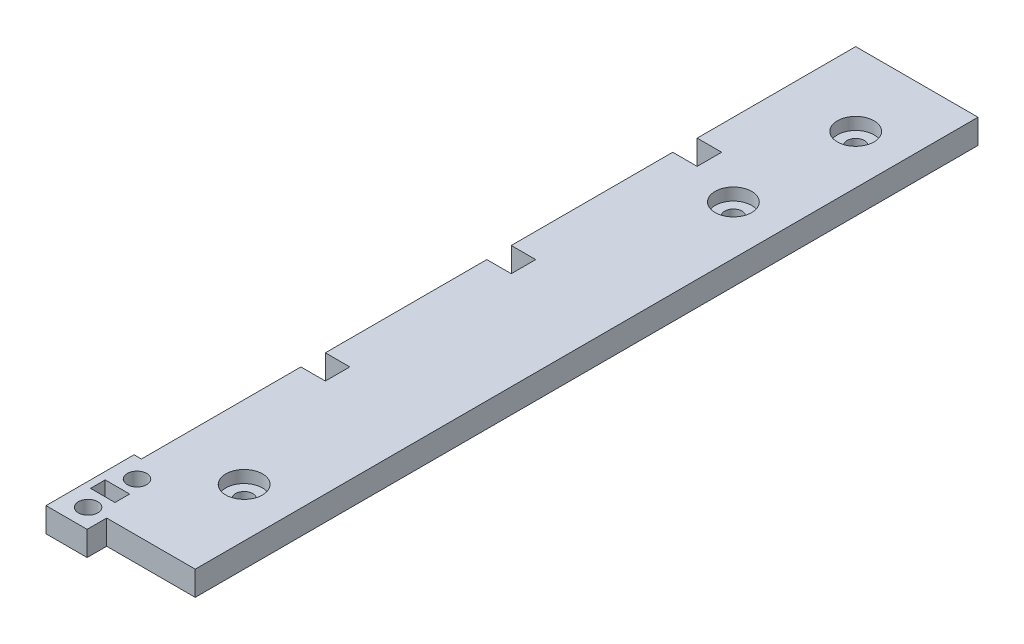
ISO-10303-21;
HEADER;
FILE_DESCRIPTION(('STEP AP214'),'2;1');
FILE_NAME('part.step','',(''),(''),'','','');
FILE_SCHEMA(('AUTOMOTIVE_DESIGN { 1 0 10303 214 1 1 1 1 }'));
ENDSEC;
DATA;
#1=APPLICATION_CONTEXT('core data for automotive mechanical design processes');
#2=APPLICATION_PROTOCOL_DEFINITION('international standard','automotive_design',2000,#1);
#3=PRODUCT_CONTEXT('',#1,'mechanical');
#4=PRODUCT('Part','Part','',(#3));
#5=PRODUCT_RELATED_PRODUCT_CATEGORY('part','',(#4));
#6=PRODUCT_DEFINITION_FORMATION('','',#4);
#7=PRODUCT_DEFINITION_CONTEXT('part definition',#1,'design');
#8=PRODUCT_DEFINITION('design','',#6,#7);
#9=PRODUCT_DEFINITION_SHAPE('','',#8);
#10=(LENGTH_UNIT() NAMED_UNIT(*) SI_UNIT(.MILLI.,.METRE.));
#11=(NAMED_UNIT(*) PLANE_ANGLE_UNIT() SI_UNIT($,.RADIAN.));
#12=(NAMED_UNIT(*) SI_UNIT($,.STERADIAN.) SOLID_ANGLE_UNIT());
#13=UNCERTAINTY_MEASURE_WITH_UNIT(LENGTH_MEASURE(1.E-05),#10,'distance_accuracy_value','');
#14=(GEOMETRIC_REPRESENTATION_CONTEXT(3) GLOBAL_UNCERTAINTY_ASSIGNED_CONTEXT((#13)) GLOBAL_UNIT_ASSIGNED_CONTEXT((#10,
#11,#12)) REPRESENTATION_CONTEXT('',''));
#15=CARTESIAN_POINT('',(0.,0.,0.));
#16=DIRECTION('',(0.,0.,1.));
#17=DIRECTION('',(1.,0.,0.));
#18=AXIS2_PLACEMENT_3D('',#15,#16,#17);
#19=CARTESIAN_POINT('',(0.,0.,0.));
#20=DIRECTION('',(0.,-1.,0.));
#21=DIRECTION('',(0.,0.,-1.));
#22=AXIS2_PLACEMENT_3D('',#19,#20,#21);
#23=PLANE('',#22);
#24=CARTESIAN_POINT('',(19.05,0.,-173.818608744557));
#25=DIRECTION('',(0.,1.,0.));
#26=DIRECTION('',(0.,0.,1.));
#27=AXIS2_PLACEMENT_3D('',#24,#25,#26);
#28=CIRCLE('',#27,2.24790000000001);
#29=CARTESIAN_POINT('',(19.05,0.,-171.570708744557));
#30=VERTEX_POINT('',#29);
#31=EDGE_CURVE('E803',#30,#30,#28,.T.);
#32=ORIENTED_EDGE('',*,*,#31,.T.);
#33=EDGE_LOOP('',(#32));
#34=FACE_BOUND('',#33,.T.);
#35=CARTESIAN_POINT('',(19.05,0.,-142.068608744557));
#36=DIRECTION('',(0.,1.,0.));
#37=DIRECTION('',(0.,0.,1.));
#38=AXIS2_PLACEMENT_3D('',#35,#36,#37);
#39=CIRCLE('',#38,2.24790000000001);
#40=CARTESIAN_POINT('',(19.05,0.,-139.820708744557));
#41=VERTEX_POINT('',#40);
#42=EDGE_CURVE('E814',#41,#41,#39,.T.);
#43=ORIENTED_EDGE('',*,*,#42,.T.);
#44=EDGE_LOOP('',(#43));
#45=FACE_BOUND('',#44,.T.);
#46=CARTESIAN_POINT('',(19.05,0.,-15.0686087445573));
#47=DIRECTION('',(0.,1.,0.));
#48=DIRECTION('',(0.,0.,1.));
#49=AXIS2_PLACEMENT_3D('',#46,#47,#48);
#50=CIRCLE('',#49,2.24790000000001);
#51=CARTESIAN_POINT('',(19.05,0.,-12.8207087445573));
#52=VERTEX_POINT('',#51);
#53=EDGE_CURVE('E217',#52,#52,#50,.T.);
#54=ORIENTED_EDGE('',*,*,#53,.T.);
#55=EDGE_LOOP('',(#54));
#56=FACE_BOUND('',#55,.T.);
#57=DIRECTION('',(0.,0.,1.));
#58=VECTOR('',#57,1.);
#59=CARTESIAN_POINT('',(0.,0.,5.75939125544268));
#60=LINE('',#59,#58);
#61=CARTESIAN_POINT('',(0.,0.,1.94939125544268));
#62=VERTEX_POINT('',#61);
#63=CARTESIAN_POINT('',(0.,0.,5.75939125544268));
#64=VERTEX_POINT('',#63);
#65=EDGE_CURVE('E196',#62,#64,#60,.T.);
#66=ORIENTED_EDGE('',*,*,#65,.T.);
#67=DIRECTION('',(1.,0.,0.));
#68=VECTOR('',#67,1.);
#69=CARTESIAN_POINT('',(6.35,0.,5.75939125544268));
#70=LINE('',#69,#68);
#71=CARTESIAN_POINT('',(6.35,0.,5.75939125544268));
#72=VERTEX_POINT('',#71);
#73=EDGE_CURVE('E205',#64,#72,#70,.T.);
#74=ORIENTED_EDGE('',*,*,#73,.T.);
#75=DIRECTION('',(0.,0.,-1.));
#76=VECTOR('',#75,1.);
#77=CARTESIAN_POINT('',(6.35,0.,1.94939125544268));
#78=LINE('',#77,#76);
#79=CARTESIAN_POINT('',(6.35,0.,1.94939125544268));
#80=VERTEX_POINT('',#79);
#81=EDGE_CURVE('E48',#72,#80,#78,.T.);
#82=ORIENTED_EDGE('',*,*,#81,.T.);
#83=DIRECTION('',(-1.,0.,0.));
#84=VECTOR('',#83,1.);
#85=CARTESIAN_POINT('',(0.,0.,1.94939125544268));
#86=LINE('',#85,#84);
#87=EDGE_CURVE('E202',#80,#62,#86,.T.);
#88=ORIENTED_EDGE('',*,*,#87,.T.);
#89=EDGE_LOOP('',(#66,#74,#82,#88));
#90=FACE_BOUND('',#89,.T.);
#91=CARTESIAN_POINT('',(3.937,0.,-2.36860874455731));
#92=DIRECTION('',(0.,1.,0.));
#93=DIRECTION('',(0.,0.,1.));
#94=AXIS2_PLACEMENT_3D('',#91,#92,#93);
#95=CIRCLE('',#94,2.52729999999999);
#96=CARTESIAN_POINT('',(3.937,0.,0.158691255442675));
#97=VERTEX_POINT('',#96);
#98=EDGE_CURVE('E235',#97,#97,#95,.T.);
#99=ORIENTED_EDGE('',*,*,#98,.T.);
#100=EDGE_LOOP('',(#99));
#101=FACE_BOUND('',#100,.T.);
#102=DIRECTION('',(-1.,0.,0.));
#103=VECTOR('',#102,1.);
#104=CARTESIAN_POINT('',(0.,0.,-55.2006087445573));
#105=LINE('',#104,#103);
#106=CARTESIAN_POINT('',(6.35000000000001,0.,-55.2006087445573));
#107=VERTEX_POINT('',#106);
#108=CARTESIAN_POINT('',(0.,0.,-55.2006087445573));
#109=VERTEX_POINT('',#108);
#110=EDGE_CURVE('E252',#107,#109,#105,.T.);
#111=ORIENTED_EDGE('',*,*,#110,.T.);
#112=DIRECTION('',(0.,0.,1.));
#113=VECTOR('',#112,1.);
#114=CARTESIAN_POINT('',(0.,0.,-7.44860874455731));
#115=LINE('',#114,#113);
#116=CARTESIAN_POINT('',(0.,0.,-97.1106087445573));
#117=VERTEX_POINT('',#116);
#118=EDGE_CURVE('E432',#117,#109,#115,.T.);
#119=ORIENTED_EDGE('',*,*,#118,.F.);
#120=DIRECTION('',(1.,0.,0.));
#121=VECTOR('',#120,1.);
#122=CARTESIAN_POINT('',(0.,0.,-97.1106087445573));
#123=LINE('',#122,#121);
#124=CARTESIAN_POINT('',(6.35,0.,-97.1106087445573));
#125=VERTEX_POINT('',#124);
#126=EDGE_CURVE('E273',#117,#125,#123,.T.);
#127=ORIENTED_EDGE('',*,*,#126,.T.);
#128=DIRECTION('',(0.,0.,-1.));
#129=VECTOR('',#128,1.);
#130=CARTESIAN_POINT('',(6.34999999999997,0.,-103.460608744557));
#131=LINE('',#130,#129);
#132=CARTESIAN_POINT('',(6.34999999999997,0.,-103.460608744557));
#133=VERTEX_POINT('',#132);
#134=EDGE_CURVE('E276',#125,#133,#131,.T.);
#135=ORIENTED_EDGE('',*,*,#134,.T.);
#136=DIRECTION('',(-1.,0.,0.));
#137=VECTOR('',#136,1.);
#138=CARTESIAN_POINT('',(0.,0.,-103.460608744557));
#139=LINE('',#138,#137);
#140=CARTESIAN_POINT('',(0.,0.,-103.460608744557));
#141=VERTEX_POINT('',#140);
#142=EDGE_CURVE('E280',#133,#141,#139,.T.);
#143=ORIENTED_EDGE('',*,*,#142,.T.);
#144=CARTESIAN_POINT('',(0.,0.,-145.370608744557));
#145=VERTEX_POINT('',#144);
#146=EDGE_CURVE('E354',#145,#141,#115,.T.);
#147=ORIENTED_EDGE('',*,*,#146,.F.);
#148=DIRECTION('',(1.,0.,0.));
#149=VECTOR('',#148,1.);
#150=CARTESIAN_POINT('',(0.,0.,-145.370608744557));
#151=LINE('',#150,#149);
#152=CARTESIAN_POINT('',(6.34999999999995,0.,-145.370608744557));
#153=VERTEX_POINT('',#152);
#154=EDGE_CURVE('E299',#145,#153,#151,.T.);
#155=ORIENTED_EDGE('',*,*,#154,.T.);
#156=DIRECTION('',(0.,0.,-1.));
#157=VECTOR('',#156,1.);
#158=CARTESIAN_POINT('',(6.34999999999995,0.,-151.720608744557));
#159=LINE('',#158,#157);
#160=CARTESIAN_POINT('',(6.34999999999995,0.,-151.720608744557));
#161=VERTEX_POINT('',#160);
#162=EDGE_CURVE('E302',#153,#161,#159,.T.);
#163=ORIENTED_EDGE('',*,*,#162,.T.);
#164=DIRECTION('',(-1.,0.,0.));
#165=VECTOR('',#164,1.);
#166=CARTESIAN_POINT('',(0.,0.,-151.720608744557));
#167=LINE('',#166,#165);
#168=CARTESIAN_POINT('',(0.,0.,-151.720608744557));
#169=VERTEX_POINT('',#168);
#170=EDGE_CURVE('E306',#161,#169,#167,.T.);
#171=ORIENTED_EDGE('',*,*,#170,.T.);
#172=CARTESIAN_POINT('',(0.,0.,-192.868608744557));
#173=VERTEX_POINT('',#172);
#174=EDGE_CURVE('E350',#173,#169,#115,.T.);
#175=ORIENTED_EDGE('',*,*,#174,.F.);
#176=DIRECTION('',(-1.,0.,0.));
#177=VECTOR('',#176,1.);
#178=CARTESIAN_POINT('',(0.,0.,-192.868608744557));
#179=LINE('',#178,#177);
#180=CARTESIAN_POINT('',(31.75,0.,-192.868608744557));
#181=VERTEX_POINT('',#180);
#182=EDGE_CURVE('E347',#181,#173,#179,.T.);
#183=ORIENTED_EDGE('',*,*,#182,.F.);
#184=DIRECTION('',(0.,0.,-1.));
#185=VECTOR('',#184,1.);
#186=CARTESIAN_POINT('',(31.75,0.,10.3313912554427));
#187=LINE('',#186,#185);
#188=CARTESIAN_POINT('',(31.75,0.,10.3313912554427));
#189=VERTEX_POINT('',#188);
#190=EDGE_CURVE('E267',#189,#181,#187,.T.);
#191=ORIENTED_EDGE('',*,*,#190,.F.);
#192=DIRECTION('',(1.,0.,0.));
#193=VECTOR('',#192,1.);
#194=CARTESIAN_POINT('',(8.763,0.,10.3313912554427));
#195=LINE('',#194,#193);
#196=CARTESIAN_POINT('',(8.763,0.,10.3313912554427));
#197=VERTEX_POINT('',#196);
#198=EDGE_CURVE('E327',#197,#189,#195,.T.);
#199=ORIENTED_EDGE('',*,*,#198,.F.);
#200=DIRECTION('',(0.,0.,-1.));
#201=VECTOR('',#200,1.);
#202=CARTESIAN_POINT('',(8.763,0.,10.3313912554427));
#203=LINE('',#202,#201);
#204=CARTESIAN_POINT('',(8.763,0.,15.4113912554427));
#205=VERTEX_POINT('',#204);
#206=EDGE_CURVE('E360',#205,#197,#203,.T.);
#207=ORIENTED_EDGE('',*,*,#206,.F.);
#208=DIRECTION('',(1.,0.,0.));
#209=VECTOR('',#208,1.);
#210=CARTESIAN_POINT('',(8.763,0.,15.4113912554427));
#211=LINE('',#210,#209);
#212=CARTESIAN_POINT('',(-1.905,0.,15.4113912554427));
#213=VERTEX_POINT('',#212);
#214=EDGE_CURVE('E358',#213,#205,#211,.T.);
#215=ORIENTED_EDGE('',*,*,#214,.F.);
#216=DIRECTION('',(0.,0.,1.));
#217=VECTOR('',#216,1.);
#218=CARTESIAN_POINT('',(-1.905,0.,15.4113912554427));
#219=LINE('',#218,#217);
#220=CARTESIAN_POINT('',(-1.905,0.,-7.44860874455731));
#221=VERTEX_POINT('',#220);
#222=EDGE_CURVE('E356',#221,#213,#219,.T.);
#223=ORIENTED_EDGE('',*,*,#222,.F.);
#224=DIRECTION('',(-1.,0.,0.));
#225=VECTOR('',#224,1.);
#226=CARTESIAN_POINT('',(-1.905,0.,-7.44860874455731));
#227=LINE('',#226,#225);
#228=CARTESIAN_POINT('',(0.,0.,-7.44860874455731));
#229=VERTEX_POINT('',#228);
#230=EDGE_CURVE('E353',#229,#221,#227,.T.);
#231=ORIENTED_EDGE('',*,*,#230,.F.);
#232=CARTESIAN_POINT('',(0.,0.,-48.8506087445573));
#233=VERTEX_POINT('',#232);
#234=EDGE_CURVE('E349',#233,#229,#115,.T.);
#235=ORIENTED_EDGE('',*,*,#234,.F.);
#236=DIRECTION('',(1.,0.,0.));
#237=VECTOR('',#236,1.);
#238=CARTESIAN_POINT('',(0.,0.,-48.8506087445573));
#239=LINE('',#238,#237);
#240=CARTESIAN_POINT('',(6.35,0.,-48.8506087445573));
#241=VERTEX_POINT('',#240);
#242=EDGE_CURVE('E245',#233,#241,#239,.T.);
#243=ORIENTED_EDGE('',*,*,#242,.T.);
#244=DIRECTION('',(0.,0.,-1.));
#245=VECTOR('',#244,1.);
#246=CARTESIAN_POINT('',(6.35000000000001,0.,-55.2006087445573));
#247=LINE('',#246,#245);
#248=EDGE_CURVE('E248',#241,#107,#247,.T.);
#249=ORIENTED_EDGE('',*,*,#248,.T.);
#250=EDGE_LOOP('',(#111,#119,#127,#135,#143,#147,#155,#163,#171,#175,#183,#191,#199,#207,#215,
#223,#231,#235,#243,#249));
#251=FACE_BOUND('',#250,.T.);
#252=CARTESIAN_POINT('',(3.937,0.,10.3313912554427));
#253=DIRECTION('',(0.,1.,0.));
#254=DIRECTION('',(0.,0.,1.));
#255=AXIS2_PLACEMENT_3D('',#252,#253,#254);
#256=CIRCLE('',#255,2.52729999999999);
#257=CARTESIAN_POINT('',(3.937,0.,12.8586912554427));
#258=VERTEX_POINT('',#257);
#259=EDGE_CURVE('E241',#258,#258,#256,.T.);
#260=ORIENTED_EDGE('',*,*,#259,.T.);
#261=EDGE_LOOP('',(#260));
#262=FACE_BOUND('',#261,.T.);
#263=ADVANCED_FACE('F33',(#34,#45,#56,#90,#101,#251,#262),#23,.T.);
#264=CARTESIAN_POINT('',(0.,6.35,-7.44860874455731));
#265=DIRECTION('',(1.,0.,0.));
#266=DIRECTION('',(0.,0.,-1.));
#267=AXIS2_PLACEMENT_3D('',#264,#265,#266);
#268=PLANE('',#267);
#269=ORIENTED_EDGE('',*,*,#118,.T.);
#270=DIRECTION('',(0.,1.,0.));
#271=VECTOR('',#270,1.);
#272=CARTESIAN_POINT('',(0.,0.,-55.2006087445573));
#273=LINE('',#272,#271);
#274=CARTESIAN_POINT('',(0.,6.35,-55.2006087445573));
#275=VERTEX_POINT('',#274);
#276=EDGE_CURVE('E264',#109,#275,#273,.T.);
#277=ORIENTED_EDGE('',*,*,#276,.T.);
#278=DIRECTION('',(0.,0.,1.));
#279=VECTOR('',#278,1.);
#280=CARTESIAN_POINT('',(0.,6.35,-7.44860874455731));
#281=LINE('',#280,#279);
#282=CARTESIAN_POINT('',(0.,6.35,-97.1106087445573));
#283=VERTEX_POINT('',#282);
#284=EDGE_CURVE('E451',#283,#275,#281,.T.);
#285=ORIENTED_EDGE('',*,*,#284,.F.);
#286=DIRECTION('',(0.,1.,0.));
#287=VECTOR('',#286,1.);
#288=CARTESIAN_POINT('',(0.,0.,-97.1106087445573));
#289=LINE('',#288,#287);
#290=EDGE_CURVE('E283',#117,#283,#289,.T.);
#291=ORIENTED_EDGE('',*,*,#290,.F.);
#292=EDGE_LOOP('',(#269,#277,#285,#291));
#293=FACE_BOUND('',#292,.T.);
#294=ADVANCED_FACE('F464',(#293),#268,.F.);
#295=ORIENTED_EDGE('',*,*,#146,.T.);
#296=DIRECTION('',(0.,1.,0.));
#297=VECTOR('',#296,1.);
#298=CARTESIAN_POINT('',(0.,0.,-103.460608744557));
#299=LINE('',#298,#297);
#300=CARTESIAN_POINT('',(0.,6.35,-103.460608744557));
#301=VERTEX_POINT('',#300);
#302=EDGE_CURVE('E260',#141,#301,#299,.T.);
#303=ORIENTED_EDGE('',*,*,#302,.T.);
#304=CARTESIAN_POINT('',(0.,6.35,-145.370608744557));
#305=VERTEX_POINT('',#304);
#306=EDGE_CURVE('E334',#305,#301,#281,.T.);
#307=ORIENTED_EDGE('',*,*,#306,.F.);
#308=DIRECTION('',(0.,1.,0.));
#309=VECTOR('',#308,1.);
#310=CARTESIAN_POINT('',(0.,0.,-145.370608744557));
#311=LINE('',#310,#309);
#312=EDGE_CURVE('E309',#145,#305,#311,.T.);
#313=ORIENTED_EDGE('',*,*,#312,.F.);
#314=EDGE_LOOP('',(#295,#303,#307,#313));
#315=FACE_BOUND('',#314,.T.);
#316=ADVANCED_FACE('F441',(#315),#268,.F.);
#317=ORIENTED_EDGE('',*,*,#174,.T.);
#318=DIRECTION('',(0.,1.,0.));
#319=VECTOR('',#318,1.);
#320=CARTESIAN_POINT('',(0.,0.,-151.720608744557));
#321=LINE('',#320,#319);
#322=CARTESIAN_POINT('',(0.,6.35,-151.720608744557));
#323=VERTEX_POINT('',#322);
#324=EDGE_CURVE('E288',#169,#323,#321,.T.);
#325=ORIENTED_EDGE('',*,*,#324,.T.);
#326=CARTESIAN_POINT('',(0.,6.35,-192.868608744557));
#327=VERTEX_POINT('',#326);
#328=EDGE_CURVE('E330',#327,#323,#281,.T.);
#329=ORIENTED_EDGE('',*,*,#328,.F.);
#330=DIRECTION('',(0.,-1.,0.));
#331=VECTOR('',#330,1.);
#332=CARTESIAN_POINT('',(0.,6.35,-192.868608744557));
#333=LINE('',#332,#331);
#334=EDGE_CURVE('E41',#327,#173,#333,.T.);
#335=ORIENTED_EDGE('',*,*,#334,.T.);
#336=EDGE_LOOP('',(#317,#325,#329,#335));
#337=FACE_BOUND('',#336,.T.);
#338=ADVANCED_FACE('F384',(#337),#268,.F.);
#339=CARTESIAN_POINT('',(31.75,6.35,10.3313912554427));
#340=DIRECTION('',(-1.,0.,0.));
#341=DIRECTION('',(0.,0.,1.));
#342=AXIS2_PLACEMENT_3D('',#339,#340,#341);
#343=PLANE('',#342);
#344=ORIENTED_EDGE('',*,*,#190,.T.);
#345=DIRECTION('',(0.,-1.,0.));
#346=VECTOR('',#345,1.);
#347=CARTESIAN_POINT('',(31.75,6.35,-192.868608744557));
#348=LINE('',#347,#346);
#349=CARTESIAN_POINT('',(31.75,6.35,-192.868608744557));
#350=VERTEX_POINT('',#349);
#351=EDGE_CURVE('E11',#350,#181,#348,.T.);
#352=ORIENTED_EDGE('',*,*,#351,.F.);
#353=DIRECTION('',(0.,0.,-1.));
#354=VECTOR('',#353,1.);
#355=CARTESIAN_POINT('',(31.75,6.35,10.3313912554427));
#356=LINE('',#355,#354);
#357=CARTESIAN_POINT('',(31.75,6.35,10.3313912554427));
#358=VERTEX_POINT('',#357);
#359=EDGE_CURVE('E323',#358,#350,#356,.T.);
#360=ORIENTED_EDGE('',*,*,#359,.F.);
#361=DIRECTION('',(0.,-1.,0.));
#362=VECTOR('',#361,1.);
#363=CARTESIAN_POINT('',(31.75,6.35,10.3313912554427));
#364=LINE('',#363,#362);
#365=EDGE_CURVE('E344',#358,#189,#364,.T.);
#366=ORIENTED_EDGE('',*,*,#365,.T.);
#367=EDGE_LOOP('',(#344,#352,#360,#366));
#368=FACE_BOUND('',#367,.T.);
#369=ADVANCED_FACE('F35',(#368),#343,.F.);
#370=CARTESIAN_POINT('',(0.,6.35,-192.868608744557));
#371=DIRECTION('',(0.,0.,1.));
#372=DIRECTION('',(1.,0.,0.));
#373=AXIS2_PLACEMENT_3D('',#370,#371,#372);
#374=PLANE('',#373);
#375=ORIENTED_EDGE('',*,*,#182,.T.);
#376=ORIENTED_EDGE('',*,*,#334,.F.);
#377=DIRECTION('',(-1.,0.,0.));
#378=VECTOR('',#377,1.);
#379=CARTESIAN_POINT('',(0.,6.35,-192.868608744557));
#380=LINE('',#379,#378);
#381=EDGE_CURVE('E326',#350,#327,#380,.T.);
#382=ORIENTED_EDGE('',*,*,#381,.F.);
#383=ORIENTED_EDGE('',*,*,#351,.T.);
#384=EDGE_LOOP('',(#375,#376,#382,#383));
#385=FACE_BOUND('',#384,.T.);
#386=ADVANCED_FACE('F399',(#385),#374,.F.);
#387=CARTESIAN_POINT('',(0.,6.35,-48.8506087445573));
#388=VERTEX_POINT('',#387);
#389=CARTESIAN_POINT('',(0.,6.35,-7.44860874455731));
#390=VERTEX_POINT('',#389);
#391=EDGE_CURVE('E329',#388,#390,#281,.T.);
#392=ORIENTED_EDGE('',*,*,#391,.F.);
#393=DIRECTION('',(0.,1.,0.));
#394=VECTOR('',#393,1.);
#395=CARTESIAN_POINT('',(0.,0.,-48.8506087445573));
#396=LINE('',#395,#394);
#397=EDGE_CURVE('E255',#233,#388,#396,.T.);
#398=ORIENTED_EDGE('',*,*,#397,.F.);
#399=ORIENTED_EDGE('',*,*,#234,.T.);
#400=DIRECTION('',(0.,-1.,0.));
#401=VECTOR('',#400,1.);
#402=CARTESIAN_POINT('',(0.,6.35,-7.44860874455731));
#403=LINE('',#402,#401);
#404=EDGE_CURVE('E377',#390,#229,#403,.T.);
#405=ORIENTED_EDGE('',*,*,#404,.F.);
#406=EDGE_LOOP('',(#392,#398,#399,#405));
#407=FACE_BOUND('',#406,.T.);
#408=ADVANCED_FACE('F430',(#407),#268,.F.);
#409=CARTESIAN_POINT('',(-1.905,6.35,-7.44860874455731));
#410=DIRECTION('',(0.,0.,1.));
#411=DIRECTION('',(1.,0.,0.));
#412=AXIS2_PLACEMENT_3D('',#409,#410,#411);
#413=PLANE('',#412);
#414=ORIENTED_EDGE('',*,*,#230,.T.);
#415=DIRECTION('',(0.,-1.,0.));
#416=VECTOR('',#415,1.);
#417=CARTESIAN_POINT('',(-1.905,6.35,-7.44860874455731));
#418=LINE('',#417,#416);
#419=CARTESIAN_POINT('',(-1.905,6.35,-7.44860874455731));
#420=VERTEX_POINT('',#419);
#421=EDGE_CURVE('E374',#420,#221,#418,.T.);
#422=ORIENTED_EDGE('',*,*,#421,.F.);
#423=DIRECTION('',(-1.,0.,0.));
#424=VECTOR('',#423,1.);
#425=CARTESIAN_POINT('',(-1.905,6.35,-7.44860874455731));
#426=LINE('',#425,#424);
#427=EDGE_CURVE('E333',#390,#420,#426,.T.);
#428=ORIENTED_EDGE('',*,*,#427,.F.);
#429=ORIENTED_EDGE('',*,*,#404,.T.);
#430=EDGE_LOOP('',(#414,#422,#428,#429));
#431=FACE_BOUND('',#430,.T.);
#432=ADVANCED_FACE('F426',(#431),#413,.F.);
#433=CARTESIAN_POINT('',(-1.905,6.35,15.4113912554427));
#434=DIRECTION('',(1.,0.,0.));
#435=DIRECTION('',(0.,0.,-1.));
#436=AXIS2_PLACEMENT_3D('',#433,#434,#435);
#437=PLANE('',#436);
#438=ORIENTED_EDGE('',*,*,#222,.T.);
#439=DIRECTION('',(0.,-1.,0.));
#440=VECTOR('',#439,1.);
#441=CARTESIAN_POINT('',(-1.905,6.35,15.4113912554427));
#442=LINE('',#441,#440);
#443=CARTESIAN_POINT('',(-1.905,6.35,15.4113912554427));
#444=VERTEX_POINT('',#443);
#445=EDGE_CURVE('E371',#444,#213,#442,.T.);
#446=ORIENTED_EDGE('',*,*,#445,.F.);
#447=DIRECTION('',(0.,0.,1.));
#448=VECTOR('',#447,1.);
#449=CARTESIAN_POINT('',(-1.905,6.35,15.4113912554427));
#450=LINE('',#449,#448);
#451=EDGE_CURVE('E336',#420,#444,#450,.T.);
#452=ORIENTED_EDGE('',*,*,#451,.F.);
#453=ORIENTED_EDGE('',*,*,#421,.T.);
#454=EDGE_LOOP('',(#438,#446,#452,#453));
#455=FACE_BOUND('',#454,.T.);
#456=ADVANCED_FACE('F421',(#455),#437,.F.);
#457=CARTESIAN_POINT('',(8.763,6.35,15.4113912554427));
#458=DIRECTION('',(0.,0.,-1.));
#459=DIRECTION('',(-1.,0.,0.));
#460=AXIS2_PLACEMENT_3D('',#457,#458,#459);
#461=PLANE('',#460);
#462=ORIENTED_EDGE('',*,*,#214,.T.);
#463=DIRECTION('',(0.,-1.,0.));
#464=VECTOR('',#463,1.);
#465=CARTESIAN_POINT('',(8.763,6.35,15.4113912554427));
#466=LINE('',#465,#464);
#467=CARTESIAN_POINT('',(8.763,6.35,15.4113912554427));
#468=VERTEX_POINT('',#467);
#469=EDGE_CURVE('E368',#468,#205,#466,.T.);
#470=ORIENTED_EDGE('',*,*,#469,.F.);
#471=DIRECTION('',(1.,0.,0.));
#472=VECTOR('',#471,1.);
#473=CARTESIAN_POINT('',(8.763,6.35,15.4113912554427));
#474=LINE('',#473,#472);
#475=EDGE_CURVE('E338',#444,#468,#474,.T.);
#476=ORIENTED_EDGE('',*,*,#475,.F.);
#477=ORIENTED_EDGE('',*,*,#445,.T.);
#478=EDGE_LOOP('',(#462,#470,#476,#477));
#479=FACE_BOUND('',#478,.T.);
#480=ADVANCED_FACE('F415',(#479),#461,.F.);
#481=CARTESIAN_POINT('',(8.763,6.35,10.3313912554427));
#482=DIRECTION('',(-1.,0.,0.));
#483=DIRECTION('',(0.,0.,1.));
#484=AXIS2_PLACEMENT_3D('',#481,#482,#483);
#485=PLANE('',#484);
#486=ORIENTED_EDGE('',*,*,#206,.T.);
#487=DIRECTION('',(0.,-1.,0.));
#488=VECTOR('',#487,1.);
#489=CARTESIAN_POINT('',(8.763,6.35,10.3313912554427));
#490=LINE('',#489,#488);
#491=CARTESIAN_POINT('',(8.763,6.35,10.3313912554427));
#492=VERTEX_POINT('',#491);
#493=EDGE_CURVE('E365',#492,#197,#490,.T.);
#494=ORIENTED_EDGE('',*,*,#493,.F.);
#495=DIRECTION('',(0.,0.,-1.));
#496=VECTOR('',#495,1.);
#497=CARTESIAN_POINT('',(8.763,6.35,10.3313912554427));
#498=LINE('',#497,#496);
#499=EDGE_CURVE('E340',#468,#492,#498,.T.);
#500=ORIENTED_EDGE('',*,*,#499,.F.);
#501=ORIENTED_EDGE('',*,*,#469,.T.);
#502=EDGE_LOOP('',(#486,#494,#500,#501));
#503=FACE_BOUND('',#502,.T.);
#504=ADVANCED_FACE('F411',(#503),#485,.F.);
#505=CARTESIAN_POINT('',(8.763,6.35,10.3313912554427));
#506=DIRECTION('',(0.,0.,-1.));
#507=DIRECTION('',(-1.,0.,0.));
#508=AXIS2_PLACEMENT_3D('',#505,#506,#507);
#509=PLANE('',#508);
#510=ORIENTED_EDGE('',*,*,#198,.T.);
#511=ORIENTED_EDGE('',*,*,#365,.F.);
#512=DIRECTION('',(1.,0.,0.));
#513=VECTOR('',#512,1.);
#514=CARTESIAN_POINT('',(8.763,6.35,10.3313912554427));
#515=LINE('',#514,#513);
#516=EDGE_CURVE('E342',#492,#358,#515,.T.);
#517=ORIENTED_EDGE('',*,*,#516,.F.);
#518=ORIENTED_EDGE('',*,*,#493,.T.);
#519=EDGE_LOOP('',(#510,#511,#517,#518));
#520=FACE_BOUND('',#519,.T.);
#521=ADVANCED_FACE('F406',(#520),#509,.F.);
#522=CARTESIAN_POINT('',(0.,6.35,0.));
#523=DIRECTION('',(0.,-1.,0.));
#524=DIRECTION('',(0.,0.,-1.));
#525=AXIS2_PLACEMENT_3D('',#522,#523,#524);
#526=PLANE('',#525);
#527=CARTESIAN_POINT('',(19.05,6.35,-173.818608744557));
#528=DIRECTION('',(0.,1.,0.));
#529=DIRECTION('',(0.,0.,1.));
#530=AXIS2_PLACEMENT_3D('',#527,#528,#529);
#531=CIRCLE('',#530,4.76249999999999);
#532=CARTESIAN_POINT('',(19.05,6.35,-169.056108744557));
#533=VERTEX_POINT('',#532);
#534=EDGE_CURVE('E796',#533,#533,#531,.T.);
#535=ORIENTED_EDGE('',*,*,#534,.F.);
#536=EDGE_LOOP('',(#535));
#537=FACE_BOUND('',#536,.T.);
#538=CARTESIAN_POINT('',(19.05,6.35,-142.068608744557));
#539=DIRECTION('',(0.,1.,0.));
#540=DIRECTION('',(0.,0.,1.));
#541=AXIS2_PLACEMENT_3D('',#538,#539,#540);
#542=CIRCLE('',#541,4.76249999999999);
#543=CARTESIAN_POINT('',(19.05,6.35,-137.306108744557));
#544=VERTEX_POINT('',#543);
#545=EDGE_CURVE('E805',#544,#544,#542,.T.);
#546=ORIENTED_EDGE('',*,*,#545,.F.);
#547=EDGE_LOOP('',(#546));
#548=FACE_BOUND('',#547,.T.);
#549=CARTESIAN_POINT('',(19.05,6.35,-15.0686087445573));
#550=DIRECTION('',(0.,1.,0.));
#551=DIRECTION('',(0.,0.,1.));
#552=AXIS2_PLACEMENT_3D('',#549,#550,#551);
#553=CIRCLE('',#552,4.76249999999999);
#554=CARTESIAN_POINT('',(19.05,6.35,-10.3061087445573));
#555=VERTEX_POINT('',#554);
#556=EDGE_CURVE('E817',#555,#555,#553,.T.);
#557=ORIENTED_EDGE('',*,*,#556,.F.);
#558=EDGE_LOOP('',(#557));
#559=FACE_BOUND('',#558,.T.);
#560=DIRECTION('',(1.,0.,0.));
#561=VECTOR('',#560,1.);
#562=CARTESIAN_POINT('',(6.35,6.35,5.75939125544268));
#563=LINE('',#562,#561);
#564=CARTESIAN_POINT('',(0.,6.35,5.75939125544268));
#565=VERTEX_POINT('',#564);
#566=CARTESIAN_POINT('',(6.35,6.35,5.75939125544268));
#567=VERTEX_POINT('',#566);
#568=EDGE_CURVE('E223',#565,#567,#563,.T.);
#569=ORIENTED_EDGE('',*,*,#568,.F.);
#570=DIRECTION('',(0.,0.,1.));
#571=VECTOR('',#570,1.);
#572=CARTESIAN_POINT('',(0.,6.35,5.75939125544268));
#573=LINE('',#572,#571);
#574=CARTESIAN_POINT('',(0.,6.35,1.94939125544268));
#575=VERTEX_POINT('',#574);
#576=EDGE_CURVE('E56',#575,#565,#573,.T.);
#577=ORIENTED_EDGE('',*,*,#576,.F.);
#578=DIRECTION('',(-1.,0.,0.));
#579=VECTOR('',#578,1.);
#580=CARTESIAN_POINT('',(0.,6.35,1.94939125544268));
#581=LINE('',#580,#579);
#582=CARTESIAN_POINT('',(6.35,6.35,1.94939125544268));
#583=VERTEX_POINT('',#582);
#584=EDGE_CURVE('E211',#583,#575,#581,.T.);
#585=ORIENTED_EDGE('',*,*,#584,.F.);
#586=DIRECTION('',(0.,0.,-1.));
#587=VECTOR('',#586,1.);
#588=CARTESIAN_POINT('',(6.35,6.35,1.94939125544268));
#589=LINE('',#588,#587);
#590=EDGE_CURVE('E214',#567,#583,#589,.T.);
#591=ORIENTED_EDGE('',*,*,#590,.F.);
#592=EDGE_LOOP('',(#569,#577,#585,#591));
#593=FACE_BOUND('',#592,.T.);
#594=CARTESIAN_POINT('',(3.937,6.35,-2.36860874455731));
#595=DIRECTION('',(0.,1.,0.));
#596=DIRECTION('',(0.,0.,1.));
#597=AXIS2_PLACEMENT_3D('',#594,#595,#596);
#598=CIRCLE('',#597,2.52729999999999);
#599=CARTESIAN_POINT('',(3.937,6.35,0.158691255442676));
#600=VERTEX_POINT('',#599);
#601=EDGE_CURVE('E229',#600,#600,#598,.T.);
#602=ORIENTED_EDGE('',*,*,#601,.F.);
#603=EDGE_LOOP('',(#602));
#604=FACE_BOUND('',#603,.T.);
#605=CARTESIAN_POINT('',(3.937,6.35,10.3313912554427));
#606=DIRECTION('',(0.,1.,0.));
#607=DIRECTION('',(0.,0.,1.));
#608=AXIS2_PLACEMENT_3D('',#605,#606,#607);
#609=CIRCLE('',#608,2.52729999999999);
#610=CARTESIAN_POINT('',(3.937,6.35,12.8586912554427));
#611=VERTEX_POINT('',#610);
#612=EDGE_CURVE('E238',#611,#611,#609,.T.);
#613=ORIENTED_EDGE('',*,*,#612,.F.);
#614=EDGE_LOOP('',(#613));
#615=FACE_BOUND('',#614,.T.);
#616=ORIENTED_EDGE('',*,*,#284,.T.);
#617=DIRECTION('',(-1.,0.,0.));
#618=VECTOR('',#617,1.);
#619=CARTESIAN_POINT('',(0.,6.35,-55.2006087445573));
#620=LINE('',#619,#618);
#621=CARTESIAN_POINT('',(6.35000000000001,6.35,-55.2006087445573));
#622=VERTEX_POINT('',#621);
#623=EDGE_CURVE('E249',#622,#275,#620,.T.);
#624=ORIENTED_EDGE('',*,*,#623,.F.);
#625=DIRECTION('',(0.,0.,-1.));
#626=VECTOR('',#625,1.);
#627=CARTESIAN_POINT('',(6.35000000000001,6.35,-55.2006087445573));
#628=LINE('',#627,#626);
#629=CARTESIAN_POINT('',(6.35,6.35,-48.8506087445573));
#630=VERTEX_POINT('',#629);
#631=EDGE_CURVE('E259',#630,#622,#628,.T.);
#632=ORIENTED_EDGE('',*,*,#631,.F.);
#633=DIRECTION('',(1.,0.,0.));
#634=VECTOR('',#633,1.);
#635=CARTESIAN_POINT('',(0.,6.35,-48.8506087445573));
#636=LINE('',#635,#634);
#637=EDGE_CURVE('E256',#388,#630,#636,.T.);
#638=ORIENTED_EDGE('',*,*,#637,.F.);
#639=ORIENTED_EDGE('',*,*,#391,.T.);
#640=ORIENTED_EDGE('',*,*,#427,.T.);
#641=ORIENTED_EDGE('',*,*,#451,.T.);
#642=ORIENTED_EDGE('',*,*,#475,.T.);
#643=ORIENTED_EDGE('',*,*,#499,.T.);
#644=ORIENTED_EDGE('',*,*,#516,.T.);
#645=ORIENTED_EDGE('',*,*,#359,.T.);
#646=ORIENTED_EDGE('',*,*,#381,.T.);
#647=ORIENTED_EDGE('',*,*,#328,.T.);
#648=DIRECTION('',(-1.,0.,0.));
#649=VECTOR('',#648,1.);
#650=CARTESIAN_POINT('',(0.,6.35,-151.720608744557));
#651=LINE('',#650,#649);
#652=CARTESIAN_POINT('',(6.34999999999995,6.35,-151.720608744557));
#653=VERTEX_POINT('',#652);
#654=EDGE_CURVE('E303',#653,#323,#651,.T.);
#655=ORIENTED_EDGE('',*,*,#654,.F.);
#656=DIRECTION('',(0.,0.,-1.));
#657=VECTOR('',#656,1.);
#658=CARTESIAN_POINT('',(6.34999999999995,6.35,-151.720608744557));
#659=LINE('',#658,#657);
#660=CARTESIAN_POINT('',(6.34999999999995,6.35,-145.370608744557));
#661=VERTEX_POINT('',#660);
#662=EDGE_CURVE('E312',#661,#653,#659,.T.);
#663=ORIENTED_EDGE('',*,*,#662,.F.);
#664=DIRECTION('',(1.,0.,0.));
#665=VECTOR('',#664,1.);
#666=CARTESIAN_POINT('',(0.,6.35,-145.370608744557));
#667=LINE('',#666,#665);
#668=EDGE_CURVE('E244',#305,#661,#667,.T.);
#669=ORIENTED_EDGE('',*,*,#668,.F.);
#670=ORIENTED_EDGE('',*,*,#306,.T.);
#671=DIRECTION('',(-1.,0.,0.));
#672=VECTOR('',#671,1.);
#673=CARTESIAN_POINT('',(0.,6.35,-103.460608744557));
#674=LINE('',#673,#672);
#675=CARTESIAN_POINT('',(6.34999999999997,6.35,-103.460608744557));
#676=VERTEX_POINT('',#675);
#677=EDGE_CURVE('E277',#676,#301,#674,.T.);
#678=ORIENTED_EDGE('',*,*,#677,.F.);
#679=DIRECTION('',(0.,0.,-1.));
#680=VECTOR('',#679,1.);
#681=CARTESIAN_POINT('',(6.34999999999997,6.35,-103.460608744557));
#682=LINE('',#681,#680);
#683=CARTESIAN_POINT('',(6.35,6.35,-97.1106087445573));
#684=VERTEX_POINT('',#683);
#685=EDGE_CURVE('E287',#684,#676,#682,.T.);
#686=ORIENTED_EDGE('',*,*,#685,.F.);
#687=DIRECTION('',(1.,0.,0.));
#688=VECTOR('',#687,1.);
#689=CARTESIAN_POINT('',(0.,6.35,-97.1106087445573));
#690=LINE('',#689,#688);
#691=EDGE_CURVE('E284',#283,#684,#690,.T.);
#692=ORIENTED_EDGE('',*,*,#691,.F.);
#693=EDGE_LOOP('',(#616,#624,#632,#638,#639,#640,#641,#642,#643,#644,#645,#646,#647,#655,#663,
#669,#670,#678,#686,#692));
#694=FACE_BOUND('',#693,.T.);
#695=ADVANCED_FACE('F395',(#537,#548,#559,#593,#604,#615,#694),#526,.F.);
#696=CARTESIAN_POINT('',(0.,0.,-151.720608744557));
#697=DIRECTION('',(0.,0.,-1.));
#698=DIRECTION('',(-1.,0.,0.));
#699=AXIS2_PLACEMENT_3D('',#696,#697,#698);
#700=PLANE('',#699);
#701=ORIENTED_EDGE('',*,*,#654,.T.);
#702=ORIENTED_EDGE('',*,*,#324,.F.);
#703=ORIENTED_EDGE('',*,*,#170,.F.);
#704=DIRECTION('',(0.,1.,0.));
#705=VECTOR('',#704,1.);
#706=CARTESIAN_POINT('',(6.34999999999995,0.,-151.720608744557));
#707=LINE('',#706,#705);
#708=EDGE_CURVE('E318',#161,#653,#707,.T.);
#709=ORIENTED_EDGE('',*,*,#708,.T.);
#710=EDGE_LOOP('',(#701,#702,#703,#709));
#711=FACE_BOUND('',#710,.T.);
#712=ADVANCED_FACE('F391',(#711),#700,.F.);
#713=CARTESIAN_POINT('',(6.34999999999995,0.,-151.720608744557));
#714=DIRECTION('',(1.,0.,0.));
#715=DIRECTION('',(0.,0.,-1.));
#716=AXIS2_PLACEMENT_3D('',#713,#714,#715);
#717=PLANE('',#716);
#718=ORIENTED_EDGE('',*,*,#662,.T.);
#719=ORIENTED_EDGE('',*,*,#708,.F.);
#720=ORIENTED_EDGE('',*,*,#162,.F.);
#721=DIRECTION('',(0.,1.,0.));
#722=VECTOR('',#721,1.);
#723=CARTESIAN_POINT('',(6.34999999999995,0.,-145.370608744557));
#724=LINE('',#723,#722);
#725=EDGE_CURVE('E320',#153,#661,#724,.T.);
#726=ORIENTED_EDGE('',*,*,#725,.T.);
#727=EDGE_LOOP('',(#718,#719,#720,#726));
#728=FACE_BOUND('',#727,.T.);
#729=ADVANCED_FACE('F574',(#728),#717,.F.);
#730=CARTESIAN_POINT('',(0.,0.,-145.370608744557));
#731=DIRECTION('',(0.,0.,1.));
#732=DIRECTION('',(1.,0.,0.));
#733=AXIS2_PLACEMENT_3D('',#730,#731,#732);
#734=PLANE('',#733);
#735=ORIENTED_EDGE('',*,*,#668,.T.);
#736=ORIENTED_EDGE('',*,*,#725,.F.);
#737=ORIENTED_EDGE('',*,*,#154,.F.);
#738=ORIENTED_EDGE('',*,*,#312,.T.);
#739=EDGE_LOOP('',(#735,#736,#737,#738));
#740=FACE_BOUND('',#739,.T.);
#741=ADVANCED_FACE('F477',(#740),#734,.F.);
#742=CARTESIAN_POINT('',(0.,0.,-103.460608744557));
#743=DIRECTION('',(0.,0.,-1.));
#744=DIRECTION('',(-1.,0.,0.));
#745=AXIS2_PLACEMENT_3D('',#742,#743,#744);
#746=PLANE('',#745);
#747=ORIENTED_EDGE('',*,*,#677,.T.);
#748=ORIENTED_EDGE('',*,*,#302,.F.);
#749=ORIENTED_EDGE('',*,*,#142,.F.);
#750=DIRECTION('',(0.,1.,0.));
#751=VECTOR('',#750,1.);
#752=CARTESIAN_POINT('',(6.34999999999997,0.,-103.460608744557));
#753=LINE('',#752,#751);
#754=EDGE_CURVE('E294',#133,#676,#753,.T.);
#755=ORIENTED_EDGE('',*,*,#754,.T.);
#756=EDGE_LOOP('',(#747,#748,#749,#755));
#757=FACE_BOUND('',#756,.T.);
#758=ADVANCED_FACE('F446',(#757),#746,.F.);
#759=CARTESIAN_POINT('',(6.34999999999997,0.,-103.460608744557));
#760=DIRECTION('',(1.,0.,0.));
#761=DIRECTION('',(0.,0.,-1.));
#762=AXIS2_PLACEMENT_3D('',#759,#760,#761);
#763=PLANE('',#762);
#764=ORIENTED_EDGE('',*,*,#685,.T.);
#765=ORIENTED_EDGE('',*,*,#754,.F.);
#766=ORIENTED_EDGE('',*,*,#134,.F.);
#767=DIRECTION('',(0.,1.,0.));
#768=VECTOR('',#767,1.);
#769=CARTESIAN_POINT('',(6.35,0.,-97.1106087445573));
#770=LINE('',#769,#768);
#771=EDGE_CURVE('E296',#125,#684,#770,.T.);
#772=ORIENTED_EDGE('',*,*,#771,.T.);
#773=EDGE_LOOP('',(#764,#765,#766,#772));
#774=FACE_BOUND('',#773,.T.);
#775=ADVANCED_FACE('F469',(#774),#763,.F.);
#776=CARTESIAN_POINT('',(0.,0.,-97.1106087445573));
#777=DIRECTION('',(0.,0.,1.));
#778=DIRECTION('',(1.,0.,0.));
#779=AXIS2_PLACEMENT_3D('',#776,#777,#778);
#780=PLANE('',#779);
#781=ORIENTED_EDGE('',*,*,#691,.T.);
#782=ORIENTED_EDGE('',*,*,#771,.F.);
#783=ORIENTED_EDGE('',*,*,#126,.F.);
#784=ORIENTED_EDGE('',*,*,#290,.T.);
#785=EDGE_LOOP('',(#781,#782,#783,#784));
#786=FACE_BOUND('',#785,.T.);
#787=ADVANCED_FACE('F467',(#786),#780,.F.);
#788=CARTESIAN_POINT('',(0.,0.,-55.2006087445573));
#789=DIRECTION('',(0.,0.,-1.));
#790=DIRECTION('',(-1.,0.,0.));
#791=AXIS2_PLACEMENT_3D('',#788,#789,#790);
#792=PLANE('',#791);
#793=ORIENTED_EDGE('',*,*,#623,.T.);
#794=ORIENTED_EDGE('',*,*,#276,.F.);
#795=ORIENTED_EDGE('',*,*,#110,.F.);
#796=DIRECTION('',(0.,1.,0.));
#797=VECTOR('',#796,1.);
#798=CARTESIAN_POINT('',(6.35000000000001,0.,-55.2006087445573));
#799=LINE('',#798,#797);
#800=EDGE_CURVE('E268',#107,#622,#799,.T.);
#801=ORIENTED_EDGE('',*,*,#800,.T.);
#802=EDGE_LOOP('',(#793,#794,#795,#801));
#803=FACE_BOUND('',#802,.T.);
#804=ADVANCED_FACE('F463',(#803),#792,.F.);
#805=CARTESIAN_POINT('',(6.35000000000001,0.,-55.2006087445573));
#806=DIRECTION('',(1.,0.,0.));
#807=DIRECTION('',(0.,0.,-1.));
#808=AXIS2_PLACEMENT_3D('',#805,#806,#807);
#809=PLANE('',#808);
#810=ORIENTED_EDGE('',*,*,#631,.T.);
#811=ORIENTED_EDGE('',*,*,#800,.F.);
#812=ORIENTED_EDGE('',*,*,#248,.F.);
#813=DIRECTION('',(0.,1.,0.));
#814=VECTOR('',#813,1.);
#815=CARTESIAN_POINT('',(6.35,0.,-48.8506087445573));
#816=LINE('',#815,#814);
#817=EDGE_CURVE('E270',#241,#630,#816,.T.);
#818=ORIENTED_EDGE('',*,*,#817,.T.);
#819=EDGE_LOOP('',(#810,#811,#812,#818));
#820=FACE_BOUND('',#819,.T.);
#821=ADVANCED_FACE('F461',(#820),#809,.F.);
#822=CARTESIAN_POINT('',(0.,0.,-48.8506087445573));
#823=DIRECTION('',(0.,0.,1.));
#824=DIRECTION('',(1.,0.,0.));
#825=AXIS2_PLACEMENT_3D('',#822,#823,#824);
#826=PLANE('',#825);
#827=ORIENTED_EDGE('',*,*,#637,.T.);
#828=ORIENTED_EDGE('',*,*,#817,.F.);
#829=ORIENTED_EDGE('',*,*,#242,.F.);
#830=ORIENTED_EDGE('',*,*,#397,.T.);
#831=EDGE_LOOP('',(#827,#828,#829,#830));
#832=FACE_BOUND('',#831,.T.);
#833=ADVANCED_FACE('F458',(#832),#826,.F.);
#834=CARTESIAN_POINT('',(3.937,6.35,10.3313912554427));
#835=DIRECTION('',(0.,1.,0.));
#836=DIRECTION('',(0.,0.,1.));
#837=AXIS2_PLACEMENT_3D('',#834,#835,#836);
#838=CYLINDRICAL_SURFACE('',#837,2.52729999999999);
#839=ORIENTED_EDGE('',*,*,#259,.F.);
#840=EDGE_LOOP('',(#839));
#841=FACE_BOUND('',#840,.T.);
#842=ORIENTED_EDGE('',*,*,#612,.T.);
#843=EDGE_LOOP('',(#842));
#844=FACE_BOUND('',#843,.T.);
#845=ADVANCED_FACE('F632',(#841,#844),#838,.F.);
#846=CARTESIAN_POINT('',(3.937,6.35,-2.36860874455731));
#847=DIRECTION('',(0.,1.,0.));
#848=DIRECTION('',(0.,0.,1.));
#849=AXIS2_PLACEMENT_3D('',#846,#847,#848);
#850=CYLINDRICAL_SURFACE('',#849,2.52729999999999);
#851=ORIENTED_EDGE('',*,*,#98,.F.);
#852=EDGE_LOOP('',(#851));
#853=FACE_BOUND('',#852,.T.);
#854=ORIENTED_EDGE('',*,*,#601,.T.);
#855=EDGE_LOOP('',(#854));
#856=FACE_BOUND('',#855,.T.);
#857=ADVANCED_FACE('F642',(#853,#856),#850,.F.);
#858=CARTESIAN_POINT('',(0.,0.,5.75939125544268));
#859=DIRECTION('',(-1.,0.,0.));
#860=DIRECTION('',(0.,0.,1.));
#861=AXIS2_PLACEMENT_3D('',#858,#859,#860);
#862=PLANE('',#861);
#863=ORIENTED_EDGE('',*,*,#576,.T.);
#864=DIRECTION('',(0.,1.,0.));
#865=VECTOR('',#864,1.);
#866=CARTESIAN_POINT('',(0.,0.,5.75939125544268));
#867=LINE('',#866,#865);
#868=EDGE_CURVE('E192',#64,#565,#867,.T.);
#869=ORIENTED_EDGE('',*,*,#868,.F.);
#870=ORIENTED_EDGE('',*,*,#65,.F.);
#871=DIRECTION('',(0.,1.,0.));
#872=VECTOR('',#871,1.);
#873=CARTESIAN_POINT('',(0.,0.,1.94939125544268));
#874=LINE('',#873,#872);
#875=EDGE_CURVE('E227',#62,#575,#874,.T.);
#876=ORIENTED_EDGE('',*,*,#875,.T.);
#877=EDGE_LOOP('',(#863,#869,#870,#876));
#878=FACE_BOUND('',#877,.T.);
#879=ADVANCED_FACE('F194',(#878),#862,.F.);
#880=CARTESIAN_POINT('',(0.,0.,1.94939125544268));
#881=DIRECTION('',(0.,0.,-1.));
#882=DIRECTION('',(-1.,0.,0.));
#883=AXIS2_PLACEMENT_3D('',#880,#881,#882);
#884=PLANE('',#883);
#885=ORIENTED_EDGE('',*,*,#584,.T.);
#886=ORIENTED_EDGE('',*,*,#875,.F.);
#887=ORIENTED_EDGE('',*,*,#87,.F.);
#888=DIRECTION('',(0.,1.,0.));
#889=VECTOR('',#888,1.);
#890=CARTESIAN_POINT('',(6.35,0.,1.94939125544268));
#891=LINE('',#890,#889);
#892=EDGE_CURVE('E230',#80,#583,#891,.T.);
#893=ORIENTED_EDGE('',*,*,#892,.T.);
#894=EDGE_LOOP('',(#885,#886,#887,#893));
#895=FACE_BOUND('',#894,.T.);
#896=ADVANCED_FACE('F661',(#895),#884,.F.);
#897=CARTESIAN_POINT('',(6.35,0.,1.94939125544268));
#898=DIRECTION('',(1.,0.,0.));
#899=DIRECTION('',(0.,0.,-1.));
#900=AXIS2_PLACEMENT_3D('',#897,#898,#899);
#901=PLANE('',#900);
#902=ORIENTED_EDGE('',*,*,#590,.T.);
#903=ORIENTED_EDGE('',*,*,#892,.F.);
#904=ORIENTED_EDGE('',*,*,#81,.F.);
#905=DIRECTION('',(0.,1.,0.));
#906=VECTOR('',#905,1.);
#907=CARTESIAN_POINT('',(6.35,0.,5.75939125544268));
#908=LINE('',#907,#906);
#909=EDGE_CURVE('E201',#72,#567,#908,.T.);
#910=ORIENTED_EDGE('',*,*,#909,.T.);
#911=EDGE_LOOP('',(#902,#903,#904,#910));
#912=FACE_BOUND('',#911,.T.);
#913=ADVANCED_FACE('F670',(#912),#901,.F.);
#914=CARTESIAN_POINT('',(6.35,0.,5.75939125544268));
#915=DIRECTION('',(0.,0.,1.));
#916=DIRECTION('',(1.,0.,0.));
#917=AXIS2_PLACEMENT_3D('',#914,#915,#916);
#918=PLANE('',#917);
#919=ORIENTED_EDGE('',*,*,#568,.T.);
#920=ORIENTED_EDGE('',*,*,#909,.F.);
#921=ORIENTED_EDGE('',*,*,#73,.F.);
#922=ORIENTED_EDGE('',*,*,#868,.T.);
#923=EDGE_LOOP('',(#919,#920,#921,#922));
#924=FACE_BOUND('',#923,.T.);
#925=ADVANCED_FACE('F206',(#924),#918,.F.);
#926=CARTESIAN_POINT('',(19.05,6.35,-15.0686087445573));
#927=DIRECTION('',(0.,1.,0.));
#928=DIRECTION('',(0.,0.,1.));
#929=AXIS2_PLACEMENT_3D('',#926,#927,#928);
#930=CYLINDRICAL_SURFACE('',#929,2.24790000000001);
#931=ORIENTED_EDGE('',*,*,#53,.F.);
#932=EDGE_LOOP('',(#931));
#933=FACE_BOUND('',#932,.T.);
#934=CARTESIAN_POINT('',(19.05,3.175,-15.0686087445573));
#935=DIRECTION('',(0.,1.,0.));
#936=DIRECTION('',(0.,0.,1.));
#937=AXIS2_PLACEMENT_3D('',#934,#935,#936);
#938=CIRCLE('',#937,2.24790000000001);
#939=CARTESIAN_POINT('',(19.05,3.175,-12.8207087445573));
#940=VERTEX_POINT('',#939);
#941=EDGE_CURVE('E822',#940,#940,#938,.T.);
#942=ORIENTED_EDGE('',*,*,#941,.T.);
#943=EDGE_LOOP('',(#942));
#944=FACE_BOUND('',#943,.T.);
#945=ADVANCED_FACE('F687',(#933,#944),#930,.F.);
#946=CARTESIAN_POINT('',(21.2979,3.175,-15.0686087445573));
#947=DIRECTION('',(0.,-1.,0.));
#948=DIRECTION('',(0.,0.,-1.));
#949=AXIS2_PLACEMENT_3D('',#946,#947,#948);
#950=PLANE('',#949);
#951=ORIENTED_EDGE('',*,*,#941,.F.);
#952=EDGE_LOOP('',(#951));
#953=FACE_BOUND('',#952,.T.);
#954=CARTESIAN_POINT('',(19.05,3.175,-15.0686087445573));
#955=DIRECTION('',(0.,1.,0.));
#956=DIRECTION('',(0.,0.,1.));
#957=AXIS2_PLACEMENT_3D('',#954,#955,#956);
#958=CIRCLE('',#957,4.76249999999999);
#959=CARTESIAN_POINT('',(19.05,3.175,-10.3061087445573));
#960=VERTEX_POINT('',#959);
#961=EDGE_CURVE('E820',#960,#960,#958,.T.);
#962=ORIENTED_EDGE('',*,*,#961,.T.);
#963=EDGE_LOOP('',(#962));
#964=FACE_BOUND('',#963,.T.);
#965=ADVANCED_FACE('F706',(#953,#964),#950,.F.);
#966=CARTESIAN_POINT('',(19.05,6.35,-15.0686087445573));
#967=DIRECTION('',(0.,1.,0.));
#968=DIRECTION('',(0.,0.,1.));
#969=AXIS2_PLACEMENT_3D('',#966,#967,#968);
#970=CYLINDRICAL_SURFACE('',#969,4.76249999999999);
#971=ORIENTED_EDGE('',*,*,#961,.F.);
#972=EDGE_LOOP('',(#971));
#973=FACE_BOUND('',#972,.T.);
#974=ORIENTED_EDGE('',*,*,#556,.T.);
#975=EDGE_LOOP('',(#974));
#976=FACE_BOUND('',#975,.T.);
#977=ADVANCED_FACE('F716',(#973,#976),#970,.F.);
#978=CARTESIAN_POINT('',(19.05,6.35,-142.068608744557));
#979=DIRECTION('',(0.,1.,0.));
#980=DIRECTION('',(0.,0.,1.));
#981=AXIS2_PLACEMENT_3D('',#978,#979,#980);
#982=CYLINDRICAL_SURFACE('',#981,2.24790000000001);
#983=ORIENTED_EDGE('',*,*,#42,.F.);
#984=EDGE_LOOP('',(#983));
#985=FACE_BOUND('',#984,.T.);
#986=CARTESIAN_POINT('',(19.05,3.175,-142.068608744557));
#987=DIRECTION('',(0.,1.,0.));
#988=DIRECTION('',(0.,0.,1.));
#989=AXIS2_PLACEMENT_3D('',#986,#987,#988);
#990=CIRCLE('',#989,2.24790000000001);
#991=CARTESIAN_POINT('',(19.05,3.175,-139.820708744557));
#992=VERTEX_POINT('',#991);
#993=EDGE_CURVE('E811',#992,#992,#990,.T.);
#994=ORIENTED_EDGE('',*,*,#993,.T.);
#995=EDGE_LOOP('',(#994));
#996=FACE_BOUND('',#995,.T.);
#997=ADVANCED_FACE('F726',(#985,#996),#982,.F.);
#998=CARTESIAN_POINT('',(21.2979,3.175,-142.068608744557));
#999=DIRECTION('',(0.,-1.,0.));
#1000=DIRECTION('',(0.,0.,-1.));
#1001=AXIS2_PLACEMENT_3D('',#998,#999,#1000);
#1002=PLANE('',#1001);
#1003=ORIENTED_EDGE('',*,*,#993,.F.);
#1004=EDGE_LOOP('',(#1003));
#1005=FACE_BOUND('',#1004,.T.);
#1006=CARTESIAN_POINT('',(19.05,3.175,-142.068608744557));
#1007=DIRECTION('',(0.,1.,0.));
#1008=DIRECTION('',(0.,0.,1.));
#1009=AXIS2_PLACEMENT_3D('',#1006,#1007,#1008);
#1010=CIRCLE('',#1009,4.76249999999999);
#1011=CARTESIAN_POINT('',(19.05,3.175,-137.306108744557));
#1012=VERTEX_POINT('',#1011);
#1013=EDGE_CURVE('E808',#1012,#1012,#1010,.T.);
#1014=ORIENTED_EDGE('',*,*,#1013,.T.);
#1015=EDGE_LOOP('',(#1014));
#1016=FACE_BOUND('',#1015,.T.);
#1017=ADVANCED_FACE('F736',(#1005,#1016),#1002,.F.);
#1018=CARTESIAN_POINT('',(19.05,6.35,-142.068608744557));
#1019=DIRECTION('',(0.,1.,0.));
#1020=DIRECTION('',(0.,0.,1.));
#1021=AXIS2_PLACEMENT_3D('',#1018,#1019,#1020);
#1022=CYLINDRICAL_SURFACE('',#1021,4.76249999999999);
#1023=ORIENTED_EDGE('',*,*,#1013,.F.);
#1024=EDGE_LOOP('',(#1023));
#1025=FACE_BOUND('',#1024,.T.);
#1026=ORIENTED_EDGE('',*,*,#545,.T.);
#1027=EDGE_LOOP('',(#1026));
#1028=FACE_BOUND('',#1027,.T.);
#1029=ADVANCED_FACE('F746',(#1025,#1028),#1022,.F.);
#1030=CARTESIAN_POINT('',(19.05,6.35,-173.818608744557));
#1031=DIRECTION('',(0.,1.,0.));
#1032=DIRECTION('',(0.,0.,1.));
#1033=AXIS2_PLACEMENT_3D('',#1030,#1031,#1032);
#1034=CYLINDRICAL_SURFACE('',#1033,2.24790000000001);
#1035=ORIENTED_EDGE('',*,*,#31,.F.);
#1036=EDGE_LOOP('',(#1035));
#1037=FACE_BOUND('',#1036,.T.);
#1038=CARTESIAN_POINT('',(19.05,3.175,-173.818608744557));
#1039=DIRECTION('',(0.,1.,0.));
#1040=DIRECTION('',(0.,0.,1.));
#1041=AXIS2_PLACEMENT_3D('',#1038,#1039,#1040);
#1042=CIRCLE('',#1041,2.24790000000001);
#1043=CARTESIAN_POINT('',(19.05,3.175,-171.570708744557));
#1044=VERTEX_POINT('',#1043);
#1045=EDGE_CURVE('E798',#1044,#1044,#1042,.T.);
#1046=ORIENTED_EDGE('',*,*,#1045,.T.);
#1047=EDGE_LOOP('',(#1046));
#1048=FACE_BOUND('',#1047,.T.);
#1049=ADVANCED_FACE('F756',(#1037,#1048),#1034,.F.);
#1050=CARTESIAN_POINT('',(21.2979,3.175,-173.818608744557));
#1051=DIRECTION('',(0.,-1.,0.));
#1052=DIRECTION('',(0.,0.,-1.));
#1053=AXIS2_PLACEMENT_3D('',#1050,#1051,#1052);
#1054=PLANE('',#1053);
#1055=ORIENTED_EDGE('',*,*,#1045,.F.);
#1056=EDGE_LOOP('',(#1055));
#1057=FACE_BOUND('',#1056,.T.);
#1058=CARTESIAN_POINT('',(19.05,3.175,-173.818608744557));
#1059=DIRECTION('',(0.,1.,0.));
#1060=DIRECTION('',(0.,0.,1.));
#1061=AXIS2_PLACEMENT_3D('',#1058,#1059,#1060);
#1062=CIRCLE('',#1061,4.76249999999999);
#1063=CARTESIAN_POINT('',(19.05,3.175,-169.056108744557));
#1064=VERTEX_POINT('',#1063);
#1065=EDGE_CURVE('E793',#1064,#1064,#1062,.T.);
#1066=ORIENTED_EDGE('',*,*,#1065,.T.);
#1067=EDGE_LOOP('',(#1066));
#1068=FACE_BOUND('',#1067,.T.);
#1069=ADVANCED_FACE('F766',(#1057,#1068),#1054,.F.);
#1070=CARTESIAN_POINT('',(19.05,6.35,-173.818608744557));
#1071=DIRECTION('',(0.,1.,0.));
#1072=DIRECTION('',(0.,0.,1.));
#1073=AXIS2_PLACEMENT_3D('',#1070,#1071,#1072);
#1074=CYLINDRICAL_SURFACE('',#1073,4.76249999999999);
#1075=ORIENTED_EDGE('',*,*,#1065,.F.);
#1076=EDGE_LOOP('',(#1075));
#1077=FACE_BOUND('',#1076,.T.);
#1078=ORIENTED_EDGE('',*,*,#534,.T.);
#1079=EDGE_LOOP('',(#1078));
#1080=FACE_BOUND('',#1079,.T.);
#1081=ADVANCED_FACE('F776',(#1077,#1080),#1074,.F.);
#1082=CLOSED_SHELL('',(#263,#294,#316,#338,#369,#386,#408,#432,#456,#480,#504,#521,#695,#712,
#729,#741,#758,#775,#787,#804,#821,#833,#845,#857,#879,#896,#913,#925,#945,#965,#977,#997,#1017,
#1029,#1049,#1069,#1081));
#1083=MANIFOLD_SOLID_BREP('B2',#1082);
#1084=ADVANCED_BREP_SHAPE_REPRESENTATION('',(#18,#1083),#14);
#1085=SHAPE_DEFINITION_REPRESENTATION(#9,#1084);
ENDSEC;
END-ISO-10303-21;
